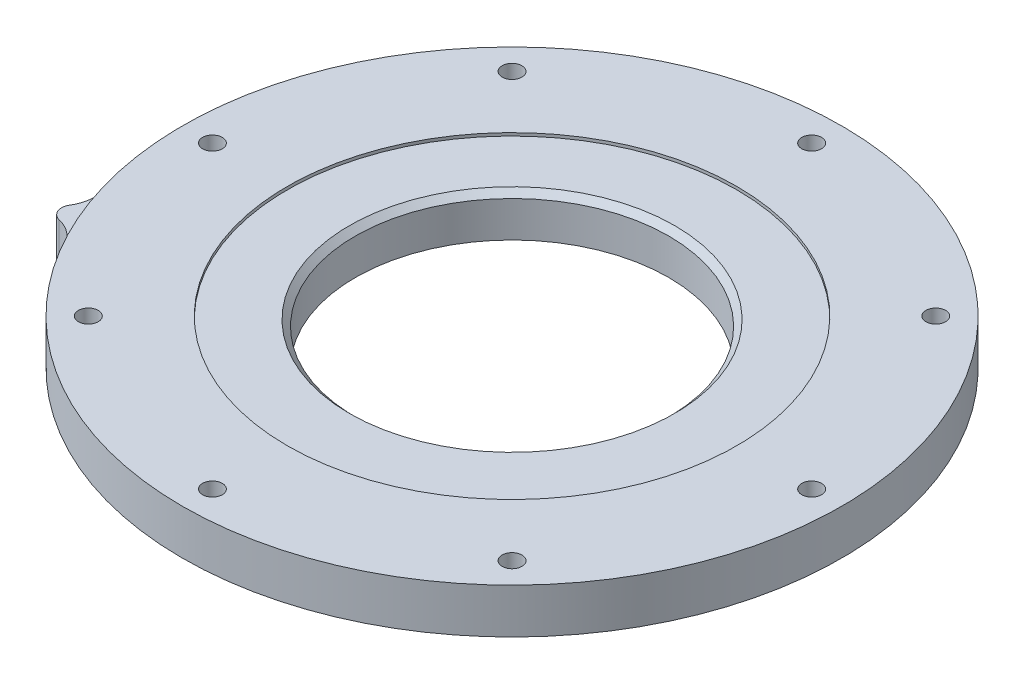
ISO-10303-21;
HEADER;
FILE_DESCRIPTION(('STEP AP214'),'2;1');
FILE_NAME('part.step','',(''),(''),'','','');
FILE_SCHEMA(('AUTOMOTIVE_DESIGN { 1 0 10303 214 1 1 1 1 }'));
ENDSEC;
DATA;
#1=APPLICATION_CONTEXT('core data for automotive mechanical design processes');
#2=APPLICATION_PROTOCOL_DEFINITION('international standard','automotive_design',2000,#1);
#3=PRODUCT_CONTEXT('',#1,'mechanical');
#4=PRODUCT('Part','Part','',(#3));
#5=PRODUCT_RELATED_PRODUCT_CATEGORY('part','',(#4));
#6=PRODUCT_DEFINITION_FORMATION('','',#4);
#7=PRODUCT_DEFINITION_CONTEXT('part definition',#1,'design');
#8=PRODUCT_DEFINITION('design','',#6,#7);
#9=PRODUCT_DEFINITION_SHAPE('','',#8);
#10=(LENGTH_UNIT() NAMED_UNIT(*) SI_UNIT(.MILLI.,.METRE.));
#11=(NAMED_UNIT(*) PLANE_ANGLE_UNIT() SI_UNIT($,.RADIAN.));
#12=(NAMED_UNIT(*) SI_UNIT($,.STERADIAN.) SOLID_ANGLE_UNIT());
#13=UNCERTAINTY_MEASURE_WITH_UNIT(LENGTH_MEASURE(1.E-05),#10,'distance_accuracy_value','');
#14=(GEOMETRIC_REPRESENTATION_CONTEXT(3) GLOBAL_UNCERTAINTY_ASSIGNED_CONTEXT((#13)) GLOBAL_UNIT_ASSIGNED_CONTEXT((#10,
#11,#12)) REPRESENTATION_CONTEXT('',''));
#15=CARTESIAN_POINT('',(0.,0.,0.));
#16=DIRECTION('',(0.,0.,1.));
#17=DIRECTION('',(1.,0.,0.));
#18=AXIS2_PLACEMENT_3D('',#15,#16,#17);
#19=CARTESIAN_POINT('',(0.,0.5,-50.));
#20=DIRECTION('',(0.,-1.,0.));
#21=DIRECTION('',(0.,0.,-1.));
#22=AXIS2_PLACEMENT_3D('',#19,#20,#21);
#23=CYLINDRICAL_SURFACE('',#22,1.65);
#24=CARTESIAN_POINT('',(0.,0.5,-50.));
#25=DIRECTION('',(0.,1.,0.));
#26=DIRECTION('',(0.,0.,1.));
#27=AXIS2_PLACEMENT_3D('',#24,#25,#26);
#28=CIRCLE('',#27,1.65);
#29=CARTESIAN_POINT('',(0.,0.5,-48.35));
#30=VERTEX_POINT('',#29);
#31=EDGE_CURVE('E143',#30,#30,#28,.T.);
#32=ORIENTED_EDGE('',*,*,#31,.T.);
#33=EDGE_LOOP('',(#32));
#34=FACE_BOUND('',#33,.T.);
#35=CARTESIAN_POINT('',(0.,-3.,-50.));
#36=DIRECTION('',(0.,-1.,0.));
#37=DIRECTION('',(0.,0.,-1.));
#38=AXIS2_PLACEMENT_3D('',#35,#36,#37);
#39=CIRCLE('',#38,1.65);
#40=CARTESIAN_POINT('',(0.,-3.,-51.65));
#41=VERTEX_POINT('',#40);
#42=EDGE_CURVE('E258',#41,#41,#39,.T.);
#43=ORIENTED_EDGE('',*,*,#42,.T.);
#44=EDGE_LOOP('',(#43));
#45=FACE_BOUND('',#44,.T.);
#46=ADVANCED_FACE('F43',(#34,#45),#23,.F.);
#47=CARTESIAN_POINT('',(35.3553390593274,0.5,-35.3553390593274));
#48=DIRECTION('',(0.,-1.,0.));
#49=DIRECTION('',(0.,0.,-1.));
#50=AXIS2_PLACEMENT_3D('',#47,#48,#49);
#51=CYLINDRICAL_SURFACE('',#50,1.65);
#52=CARTESIAN_POINT('',(35.3553390593274,0.5,-35.3553390593274));
#53=DIRECTION('',(0.,1.,0.));
#54=DIRECTION('',(0.,0.,1.));
#55=AXIS2_PLACEMENT_3D('',#52,#53,#54);
#56=CIRCLE('',#55,1.65);
#57=CARTESIAN_POINT('',(35.3553390593274,0.5,-33.7053390593274));
#58=VERTEX_POINT('',#57);
#59=EDGE_CURVE('E140',#58,#58,#56,.T.);
#60=ORIENTED_EDGE('',*,*,#59,.T.);
#61=EDGE_LOOP('',(#60));
#62=FACE_BOUND('',#61,.T.);
#63=CARTESIAN_POINT('',(35.3553390593274,-3.,-35.3553390593274));
#64=DIRECTION('',(0.,-1.,0.));
#65=DIRECTION('',(0.,0.,-1.));
#66=AXIS2_PLACEMENT_3D('',#63,#64,#65);
#67=CIRCLE('',#66,1.65);
#68=CARTESIAN_POINT('',(35.3553390593274,-3.,-37.0053390593274));
#69=VERTEX_POINT('',#68);
#70=EDGE_CURVE('E249',#69,#69,#67,.T.);
#71=ORIENTED_EDGE('',*,*,#70,.T.);
#72=EDGE_LOOP('',(#71));
#73=FACE_BOUND('',#72,.T.);
#74=ADVANCED_FACE('F177',(#62,#73),#51,.F.);
#75=CARTESIAN_POINT('',(50.,0.5,0.));
#76=DIRECTION('',(0.,-1.,0.));
#77=DIRECTION('',(0.,0.,-1.));
#78=AXIS2_PLACEMENT_3D('',#75,#76,#77);
#79=CYLINDRICAL_SURFACE('',#78,1.65);
#80=CARTESIAN_POINT('',(50.,0.5,0.));
#81=DIRECTION('',(0.,1.,0.));
#82=DIRECTION('',(0.,0.,1.));
#83=AXIS2_PLACEMENT_3D('',#80,#81,#82);
#84=CIRCLE('',#83,1.65);
#85=CARTESIAN_POINT('',(50.,0.5,1.65));
#86=VERTEX_POINT('',#85);
#87=EDGE_CURVE('E137',#86,#86,#84,.T.);
#88=ORIENTED_EDGE('',*,*,#87,.T.);
#89=EDGE_LOOP('',(#88));
#90=FACE_BOUND('',#89,.T.);
#91=CARTESIAN_POINT('',(50.,-3.,0.));
#92=DIRECTION('',(0.,-1.,0.));
#93=DIRECTION('',(0.,0.,-1.));
#94=AXIS2_PLACEMENT_3D('',#91,#92,#93);
#95=CIRCLE('',#94,1.65);
#96=CARTESIAN_POINT('',(50.,-3.,-1.65000000000001));
#97=VERTEX_POINT('',#96);
#98=EDGE_CURVE('E240',#97,#97,#95,.T.);
#99=ORIENTED_EDGE('',*,*,#98,.T.);
#100=EDGE_LOOP('',(#99));
#101=FACE_BOUND('',#100,.T.);
#102=ADVANCED_FACE('F183',(#90,#101),#79,.F.);
#103=CARTESIAN_POINT('',(35.3553390593274,0.5,35.3553390593274));
#104=DIRECTION('',(0.,-1.,0.));
#105=DIRECTION('',(0.,0.,-1.));
#106=AXIS2_PLACEMENT_3D('',#103,#104,#105);
#107=CYLINDRICAL_SURFACE('',#106,1.65);
#108=CARTESIAN_POINT('',(35.3553390593274,0.5,35.3553390593274));
#109=DIRECTION('',(0.,1.,0.));
#110=DIRECTION('',(0.,0.,1.));
#111=AXIS2_PLACEMENT_3D('',#108,#109,#110);
#112=CIRCLE('',#111,1.65);
#113=CARTESIAN_POINT('',(35.3553390593274,0.5,37.0053390593274));
#114=VERTEX_POINT('',#113);
#115=EDGE_CURVE('E134',#114,#114,#112,.T.);
#116=ORIENTED_EDGE('',*,*,#115,.T.);
#117=EDGE_LOOP('',(#116));
#118=FACE_BOUND('',#117,.T.);
#119=CARTESIAN_POINT('',(35.3553390593274,-3.,35.3553390593274));
#120=DIRECTION('',(0.,-1.,0.));
#121=DIRECTION('',(0.,0.,-1.));
#122=AXIS2_PLACEMENT_3D('',#119,#120,#121);
#123=CIRCLE('',#122,1.65);
#124=CARTESIAN_POINT('',(35.3553390593274,-3.,33.7053390593274));
#125=VERTEX_POINT('',#124);
#126=EDGE_CURVE('E231',#125,#125,#123,.T.);
#127=ORIENTED_EDGE('',*,*,#126,.T.);
#128=EDGE_LOOP('',(#127));
#129=FACE_BOUND('',#128,.T.);
#130=ADVANCED_FACE('F356',(#118,#129),#107,.F.);
#131=CARTESIAN_POINT('',(0.,0.5,50.));
#132=DIRECTION('',(0.,-1.,0.));
#133=DIRECTION('',(0.,0.,-1.));
#134=AXIS2_PLACEMENT_3D('',#131,#132,#133);
#135=CYLINDRICAL_SURFACE('',#134,1.65);
#136=CARTESIAN_POINT('',(0.,0.5,50.));
#137=DIRECTION('',(0.,1.,0.));
#138=DIRECTION('',(0.,0.,1.));
#139=AXIS2_PLACEMENT_3D('',#136,#137,#138);
#140=CIRCLE('',#139,1.65);
#141=CARTESIAN_POINT('',(0.,0.5,51.65));
#142=VERTEX_POINT('',#141);
#143=EDGE_CURVE('E131',#142,#142,#140,.T.);
#144=ORIENTED_EDGE('',*,*,#143,.T.);
#145=EDGE_LOOP('',(#144));
#146=FACE_BOUND('',#145,.T.);
#147=CARTESIAN_POINT('',(0.,-3.,50.));
#148=DIRECTION('',(0.,-1.,0.));
#149=DIRECTION('',(0.,0.,-1.));
#150=AXIS2_PLACEMENT_3D('',#147,#148,#149);
#151=CIRCLE('',#150,1.65);
#152=CARTESIAN_POINT('',(0.,-3.,48.35));
#153=VERTEX_POINT('',#152);
#154=EDGE_CURVE('E222',#153,#153,#151,.T.);
#155=ORIENTED_EDGE('',*,*,#154,.T.);
#156=EDGE_LOOP('',(#155));
#157=FACE_BOUND('',#156,.T.);
#158=ADVANCED_FACE('F352',(#146,#157),#135,.F.);
#159=CARTESIAN_POINT('',(-35.3553390593274,0.5,35.3553390593274));
#160=DIRECTION('',(0.,-1.,0.));
#161=DIRECTION('',(0.,0.,-1.));
#162=AXIS2_PLACEMENT_3D('',#159,#160,#161);
#163=CYLINDRICAL_SURFACE('',#162,1.65);
#164=CARTESIAN_POINT('',(-35.3553390593274,0.5,35.3553390593274));
#165=DIRECTION('',(0.,1.,0.));
#166=DIRECTION('',(0.,0.,1.));
#167=AXIS2_PLACEMENT_3D('',#164,#165,#166);
#168=CIRCLE('',#167,1.65);
#169=CARTESIAN_POINT('',(-35.3553390593274,0.5,37.0053390593274));
#170=VERTEX_POINT('',#169);
#171=EDGE_CURVE('E128',#170,#170,#168,.T.);
#172=ORIENTED_EDGE('',*,*,#171,.T.);
#173=EDGE_LOOP('',(#172));
#174=FACE_BOUND('',#173,.T.);
#175=CARTESIAN_POINT('',(-35.3553390593274,-3.,35.3553390593274));
#176=DIRECTION('',(0.,-1.,0.));
#177=DIRECTION('',(0.,0.,-1.));
#178=AXIS2_PLACEMENT_3D('',#175,#176,#177);
#179=CIRCLE('',#178,1.65);
#180=CARTESIAN_POINT('',(-35.3553390593274,-3.,33.7053390593274));
#181=VERTEX_POINT('',#180);
#182=EDGE_CURVE('E212',#181,#181,#179,.T.);
#183=ORIENTED_EDGE('',*,*,#182,.T.);
#184=EDGE_LOOP('',(#183));
#185=FACE_BOUND('',#184,.T.);
#186=ADVANCED_FACE('F348',(#174,#185),#163,.F.);
#187=CARTESIAN_POINT('',(-50.,0.5,0.));
#188=DIRECTION('',(0.,-1.,0.));
#189=DIRECTION('',(0.,0.,-1.));
#190=AXIS2_PLACEMENT_3D('',#187,#188,#189);
#191=CYLINDRICAL_SURFACE('',#190,1.65);
#192=CARTESIAN_POINT('',(-50.,0.5,0.));
#193=DIRECTION('',(0.,1.,0.));
#194=DIRECTION('',(0.,0.,1.));
#195=AXIS2_PLACEMENT_3D('',#192,#193,#194);
#196=CIRCLE('',#195,1.65);
#197=CARTESIAN_POINT('',(-50.,0.5,1.65000000000001));
#198=VERTEX_POINT('',#197);
#199=EDGE_CURVE('E125',#198,#198,#196,.T.);
#200=ORIENTED_EDGE('',*,*,#199,.T.);
#201=EDGE_LOOP('',(#200));
#202=FACE_BOUND('',#201,.T.);
#203=CARTESIAN_POINT('',(-50.,-3.,0.));
#204=DIRECTION('',(0.,-1.,0.));
#205=DIRECTION('',(0.,0.,-1.));
#206=AXIS2_PLACEMENT_3D('',#203,#204,#205);
#207=CIRCLE('',#206,1.65);
#208=CARTESIAN_POINT('',(-50.,-3.,-1.64999999999999));
#209=VERTEX_POINT('',#208);
#210=EDGE_CURVE('E270',#209,#209,#207,.T.);
#211=ORIENTED_EDGE('',*,*,#210,.T.);
#212=EDGE_LOOP('',(#211));
#213=FACE_BOUND('',#212,.T.);
#214=ADVANCED_FACE('F284',(#202,#213),#191,.F.);
#215=CARTESIAN_POINT('',(-35.3553390593274,0.5,-35.3553390593274));
#216=DIRECTION('',(0.,-1.,0.));
#217=DIRECTION('',(0.,0.,-1.));
#218=AXIS2_PLACEMENT_3D('',#215,#216,#217);
#219=CYLINDRICAL_SURFACE('',#218,1.65);
#220=CARTESIAN_POINT('',(-35.3553390593274,0.5,-35.3553390593274));
#221=DIRECTION('',(0.,1.,0.));
#222=DIRECTION('',(0.,0.,1.));
#223=AXIS2_PLACEMENT_3D('',#220,#221,#222);
#224=CIRCLE('',#223,1.65);
#225=CARTESIAN_POINT('',(-35.3553390593274,0.5,-33.7053390593274));
#226=VERTEX_POINT('',#225);
#227=EDGE_CURVE('E122',#226,#226,#224,.T.);
#228=ORIENTED_EDGE('',*,*,#227,.T.);
#229=EDGE_LOOP('',(#228));
#230=FACE_BOUND('',#229,.T.);
#231=CARTESIAN_POINT('',(-35.3553390593274,-3.,-35.3553390593274));
#232=DIRECTION('',(0.,-1.,0.));
#233=DIRECTION('',(0.,0.,-1.));
#234=AXIS2_PLACEMENT_3D('',#231,#232,#233);
#235=CIRCLE('',#234,1.65);
#236=CARTESIAN_POINT('',(-35.3553390593274,-3.,-37.0053390593274));
#237=VERTEX_POINT('',#236);
#238=EDGE_CURVE('E267',#237,#237,#235,.T.);
#239=ORIENTED_EDGE('',*,*,#238,.T.);
#240=EDGE_LOOP('',(#239));
#241=FACE_BOUND('',#240,.T.);
#242=ADVANCED_FACE('F196',(#230,#241),#219,.F.);
#243=CARTESIAN_POINT('',(0.,0.5,0.));
#244=DIRECTION('',(0.,1.,0.));
#245=DIRECTION('',(0.,0.,1.));
#246=AXIS2_PLACEMENT_3D('',#243,#244,#245);
#247=PLANE('',#246);
#248=ORIENTED_EDGE('',*,*,#199,.F.);
#249=EDGE_LOOP('',(#248));
#250=FACE_BOUND('',#249,.T.);
#251=ORIENTED_EDGE('',*,*,#143,.F.);
#252=EDGE_LOOP('',(#251));
#253=FACE_BOUND('',#252,.T.);
#254=ORIENTED_EDGE('',*,*,#87,.F.);
#255=EDGE_LOOP('',(#254));
#256=FACE_BOUND('',#255,.T.);
#257=ORIENTED_EDGE('',*,*,#31,.F.);
#258=EDGE_LOOP('',(#257));
#259=FACE_BOUND('',#258,.T.);
#260=CARTESIAN_POINT('',(0.,0.5,0.));
#261=DIRECTION('',(0.,1.,0.));
#262=DIRECTION('',(0.,0.,1.));
#263=AXIS2_PLACEMENT_3D('',#260,#261,#262);
#264=CIRCLE('',#263,55.);
#265=CARTESIAN_POINT('',(0.,0.5,55.));
#266=VERTEX_POINT('',#265);
#267=EDGE_CURVE('E153',#266,#266,#264,.T.);
#268=ORIENTED_EDGE('',*,*,#267,.T.);
#269=EDGE_LOOP('',(#268));
#270=FACE_BOUND('',#269,.T.);
#271=CARTESIAN_POINT('',(0.,0.5,0.));
#272=DIRECTION('',(0.,1.,0.));
#273=DIRECTION('',(0.,0.,1.));
#274=AXIS2_PLACEMENT_3D('',#271,#272,#273);
#275=CIRCLE('',#274,37.5);
#276=CARTESIAN_POINT('',(0.,0.5,37.5));
#277=VERTEX_POINT('',#276);
#278=EDGE_CURVE('E147',#277,#277,#275,.T.);
#279=ORIENTED_EDGE('',*,*,#278,.F.);
#280=EDGE_LOOP('',(#279));
#281=FACE_BOUND('',#280,.T.);
#282=ORIENTED_EDGE('',*,*,#59,.F.);
#283=EDGE_LOOP('',(#282));
#284=FACE_BOUND('',#283,.T.);
#285=ORIENTED_EDGE('',*,*,#115,.F.);
#286=EDGE_LOOP('',(#285));
#287=FACE_BOUND('',#286,.T.);
#288=ORIENTED_EDGE('',*,*,#171,.F.);
#289=EDGE_LOOP('',(#288));
#290=FACE_BOUND('',#289,.T.);
#291=ORIENTED_EDGE('',*,*,#227,.F.);
#292=EDGE_LOOP('',(#291));
#293=FACE_BOUND('',#292,.T.);
#294=ADVANCED_FACE('F194',(#250,#253,#256,#259,#270,#281,#284,#287,#290,#293),#247,.T.);
#295=CARTESIAN_POINT('',(0.,0.5,0.));
#296=DIRECTION('',(0.,-1.,0.));
#297=DIRECTION('',(0.,0.,-1.));
#298=AXIS2_PLACEMENT_3D('',#295,#296,#297);
#299=CYLINDRICAL_SURFACE('',#298,55.);
#300=ORIENTED_EDGE('',*,*,#267,.F.);
#301=EDGE_LOOP('',(#300));
#302=FACE_BOUND('',#301,.T.);
#303=CARTESIAN_POINT('',(0.,0.,0.));
#304=DIRECTION('',(0.,1.,0.));
#305=DIRECTION('',(0.,0.,1.));
#306=AXIS2_PLACEMENT_3D('',#303,#304,#305);
#307=CIRCLE('',#306,55.);
#308=CARTESIAN_POINT('',(-52.7690267796825,0.,15.5057993255799));
#309=VERTEX_POINT('',#308);
#310=CARTESIAN_POINT('',(-48.2775925233631,0.,26.349080821693));
#311=VERTEX_POINT('',#310);
#312=EDGE_CURVE('E150',#309,#311,#307,.T.);
#313=ORIENTED_EDGE('',*,*,#312,.T.);
#314=DIRECTION('',(0.,1.,0.));
#315=VECTOR('',#314,1.);
#316=CARTESIAN_POINT('',(-48.2775925233631,-7.,26.349080821693));
#317=LINE('',#316,#315);
#318=CARTESIAN_POINT('',(-48.2775925233631,-7.,26.349080821693));
#319=VERTEX_POINT('',#318);
#320=EDGE_CURVE('E84',#319,#311,#317,.T.);
#321=ORIENTED_EDGE('',*,*,#320,.F.);
#322=CARTESIAN_POINT('',(0.,-7.,0.));
#323=DIRECTION('',(0.,-1.,0.));
#324=DIRECTION('',(0.,0.,-1.));
#325=AXIS2_PLACEMENT_3D('',#322,#323,#324);
#326=CIRCLE('',#325,55.);
#327=CARTESIAN_POINT('',(-52.7690267796825,-7.,15.5057993255799));
#328=VERTEX_POINT('',#327);
#329=EDGE_CURVE('E67',#328,#319,#326,.T.);
#330=ORIENTED_EDGE('',*,*,#329,.F.);
#331=DIRECTION('',(0.,1.,0.));
#332=VECTOR('',#331,1.);
#333=CARTESIAN_POINT('',(-52.7690267796825,-7.,15.5057993255799));
#334=LINE('',#333,#332);
#335=EDGE_CURVE('E59',#328,#309,#334,.T.);
#336=ORIENTED_EDGE('',*,*,#335,.T.);
#337=EDGE_LOOP('',(#313,#321,#330,#336));
#338=FACE_BOUND('',#337,.T.);
#339=ADVANCED_FACE('F192',(#302,#338),#299,.T.);
#340=CARTESIAN_POINT('',(0.,0.5,0.));
#341=DIRECTION('',(0.,-1.,0.));
#342=DIRECTION('',(0.,0.,-1.));
#343=AXIS2_PLACEMENT_3D('',#340,#341,#342);
#344=CYLINDRICAL_SURFACE('',#343,37.5);
#345=ORIENTED_EDGE('',*,*,#278,.T.);
#346=EDGE_LOOP('',(#345));
#347=FACE_BOUND('',#346,.T.);
#348=CARTESIAN_POINT('',(0.,0.,0.));
#349=DIRECTION('',(0.,1.,0.));
#350=DIRECTION('',(0.,0.,1.));
#351=AXIS2_PLACEMENT_3D('',#348,#349,#350);
#352=CIRCLE('',#351,37.5);
#353=CARTESIAN_POINT('',(0.,0.,37.5));
#354=VERTEX_POINT('',#353);
#355=EDGE_CURVE('E146',#354,#354,#352,.T.);
#356=ORIENTED_EDGE('',*,*,#355,.F.);
#357=EDGE_LOOP('',(#356));
#358=FACE_BOUND('',#357,.T.);
#359=ADVANCED_FACE('F189',(#347,#358),#344,.F.);
#360=CARTESIAN_POINT('',(-26.7721194902286,0.,14.6117630011207));
#361=DIRECTION('',(0.,-1.,0.));
#362=DIRECTION('',(0.,0.,-1.));
#363=AXIS2_PLACEMENT_3D('',#360,#361,#362);
#364=PLANE('',#363);
#365=CARTESIAN_POINT('',(0.,0.,0.));
#366=DIRECTION('',(0.,-1.,0.));
#367=DIRECTION('',(0.,0.,-1.));
#368=AXIS2_PLACEMENT_3D('',#365,#366,#367);
#369=CIRCLE('',#368,27.15);
#370=CARTESIAN_POINT('',(0.,0.,-27.15));
#371=VERTEX_POINT('',#370);
#372=EDGE_CURVE('E52',#371,#371,#369,.T.);
#373=ORIENTED_EDGE('',*,*,#372,.T.);
#374=EDGE_LOOP('',(#373));
#375=FACE_BOUND('',#374,.T.);
#376=ORIENTED_EDGE('',*,*,#355,.T.);
#377=EDGE_LOOP('',(#376));
#378=FACE_BOUND('',#377,.T.);
#379=ADVANCED_FACE('F159',(#375,#378),#364,.F.);
#380=CARTESIAN_POINT('',(-26.7721194902286,-7.,14.6117630011207));
#381=DIRECTION('',(0.,-1.,0.));
#382=DIRECTION('',(0.,0.,-1.));
#383=AXIS2_PLACEMENT_3D('',#380,#381,#382);
#384=PLANE('',#383);
#385=CARTESIAN_POINT('',(-50.,-7.,0.));
#386=DIRECTION('',(0.,-1.,0.));
#387=DIRECTION('',(0.,0.,-1.));
#388=AXIS2_PLACEMENT_3D('',#385,#386,#387);
#389=CIRCLE('',#388,3.65);
#390=CARTESIAN_POINT('',(-50.,-7.,-3.64999999999999));
#391=VERTEX_POINT('',#390);
#392=EDGE_CURVE('E276',#391,#391,#389,.T.);
#393=ORIENTED_EDGE('',*,*,#392,.F.);
#394=EDGE_LOOP('',(#393));
#395=FACE_BOUND('',#394,.T.);
#396=CARTESIAN_POINT('',(-35.3553390593274,-7.,-35.3553390593274));
#397=DIRECTION('',(0.,-1.,0.));
#398=DIRECTION('',(0.,0.,-1.));
#399=AXIS2_PLACEMENT_3D('',#396,#397,#398);
#400=CIRCLE('',#399,3.64999999999999);
#401=CARTESIAN_POINT('',(-35.3553390593274,-7.,-39.0053390593274));
#402=VERTEX_POINT('',#401);
#403=EDGE_CURVE('E271',#402,#402,#400,.T.);
#404=ORIENTED_EDGE('',*,*,#403,.F.);
#405=EDGE_LOOP('',(#404));
#406=FACE_BOUND('',#405,.T.);
#407=CARTESIAN_POINT('',(0.,-7.,-50.));
#408=DIRECTION('',(0.,-1.,0.));
#409=DIRECTION('',(0.,0.,-1.));
#410=AXIS2_PLACEMENT_3D('',#407,#408,#409);
#411=CIRCLE('',#410,3.65);
#412=CARTESIAN_POINT('',(0.,-7.,-53.65));
#413=VERTEX_POINT('',#412);
#414=EDGE_CURVE('E262',#413,#413,#411,.T.);
#415=ORIENTED_EDGE('',*,*,#414,.F.);
#416=EDGE_LOOP('',(#415));
#417=FACE_BOUND('',#416,.T.);
#418=CARTESIAN_POINT('',(35.3553390593274,-7.,-35.3553390593274));
#419=DIRECTION('',(0.,-1.,0.));
#420=DIRECTION('',(0.,0.,-1.));
#421=AXIS2_PLACEMENT_3D('',#418,#419,#420);
#422=CIRCLE('',#421,3.65);
#423=CARTESIAN_POINT('',(35.3553390593274,-7.,-39.0053390593274));
#424=VERTEX_POINT('',#423);
#425=EDGE_CURVE('E253',#424,#424,#422,.T.);
#426=ORIENTED_EDGE('',*,*,#425,.F.);
#427=EDGE_LOOP('',(#426));
#428=FACE_BOUND('',#427,.T.);
#429=CARTESIAN_POINT('',(50.,-7.,0.));
#430=DIRECTION('',(0.,-1.,0.));
#431=DIRECTION('',(0.,0.,-1.));
#432=AXIS2_PLACEMENT_3D('',#429,#430,#431);
#433=CIRCLE('',#432,3.65);
#434=CARTESIAN_POINT('',(50.,-7.,-3.65));
#435=VERTEX_POINT('',#434);
#436=EDGE_CURVE('E244',#435,#435,#433,.T.);
#437=ORIENTED_EDGE('',*,*,#436,.F.);
#438=EDGE_LOOP('',(#437));
#439=FACE_BOUND('',#438,.T.);
#440=CARTESIAN_POINT('',(35.3553390593274,-7.,35.3553390593274));
#441=DIRECTION('',(0.,-1.,0.));
#442=DIRECTION('',(0.,0.,-1.));
#443=AXIS2_PLACEMENT_3D('',#440,#441,#442);
#444=CIRCLE('',#443,3.64999999999999);
#445=CARTESIAN_POINT('',(35.3553390593274,-7.,31.7053390593274));
#446=VERTEX_POINT('',#445);
#447=EDGE_CURVE('E235',#446,#446,#444,.T.);
#448=ORIENTED_EDGE('',*,*,#447,.F.);
#449=EDGE_LOOP('',(#448));
#450=FACE_BOUND('',#449,.T.);
#451=CARTESIAN_POINT('',(0.,-7.,50.));
#452=DIRECTION('',(0.,-1.,0.));
#453=DIRECTION('',(0.,0.,-1.));
#454=AXIS2_PLACEMENT_3D('',#451,#452,#453);
#455=CIRCLE('',#454,3.65);
#456=CARTESIAN_POINT('',(0.,-7.,46.35));
#457=VERTEX_POINT('',#456);
#458=EDGE_CURVE('E226',#457,#457,#455,.T.);
#459=ORIENTED_EDGE('',*,*,#458,.F.);
#460=EDGE_LOOP('',(#459));
#461=FACE_BOUND('',#460,.T.);
#462=CARTESIAN_POINT('',(-35.3553390593274,-7.,35.3553390593274));
#463=DIRECTION('',(0.,-1.,0.));
#464=DIRECTION('',(0.,0.,-1.));
#465=AXIS2_PLACEMENT_3D('',#462,#463,#464);
#466=CIRCLE('',#465,3.65);
#467=CARTESIAN_POINT('',(-35.3553390593274,-7.,31.7053390593274));
#468=VERTEX_POINT('',#467);
#469=EDGE_CURVE('E216',#468,#468,#466,.T.);
#470=ORIENTED_EDGE('',*,*,#469,.F.);
#471=EDGE_LOOP('',(#470));
#472=FACE_BOUND('',#471,.T.);
#473=CARTESIAN_POINT('',(-53.5442389804573,-7.,29.2235260022414));
#474=DIRECTION('',(0.,1.,0.));
#475=DIRECTION('',(0.,0.,-1.));
#476=AXIS2_PLACEMENT_3D('',#473,#474,#475);
#477=CIRCLE('',#476,6.);
#478=CARTESIAN_POINT('',(-52.1890001105883,-7.,23.3785856598943));
#479=VERTEX_POINT('',#478);
#480=EDGE_CURVE('E97',#319,#479,#477,.T.);
#481=ORIENTED_EDGE('',*,*,#480,.T.);
#482=CARTESIAN_POINT('',(-51.737253820632,-7.,21.4302722124452));
#483=DIRECTION('',(0.,-1.,0.));
#484=DIRECTION('',(0.,0.,-1.));
#485=AXIS2_PLACEMENT_3D('',#482,#483,#484);
#486=CIRCLE('',#485,2.00000000000006);
#487=CARTESIAN_POINT('',(-53.4343523362041,-7.,20.3720394268811));
#488=VERTEX_POINT('',#487);
#489=EDGE_CURVE('E92',#479,#488,#486,.T.);
#490=ORIENTED_EDGE('',*,*,#489,.T.);
#491=CARTESIAN_POINT('',(-58.5256478829206,-7.,17.1973410701886));
#492=DIRECTION('',(0.,1.,0.));
#493=DIRECTION('',(0.,0.,1.));
#494=AXIS2_PLACEMENT_3D('',#491,#492,#493);
#495=CIRCLE('',#494,6.);
#496=EDGE_CURVE('E96',#488,#328,#495,.T.);
#497=ORIENTED_EDGE('',*,*,#496,.T.);
#498=ORIENTED_EDGE('',*,*,#329,.T.);
#499=EDGE_LOOP('',(#481,#490,#497,#498));
#500=FACE_BOUND('',#499,.T.);
#501=CARTESIAN_POINT('',(0.,-7.,0.));
#502=DIRECTION('',(0.,-1.,0.));
#503=DIRECTION('',(0.,0.,-1.));
#504=AXIS2_PLACEMENT_3D('',#501,#502,#503);
#505=CIRCLE('',#504,26.15);
#506=CARTESIAN_POINT('',(0.,-7.,-26.15));
#507=VERTEX_POINT('',#506);
#508=EDGE_CURVE('E115',#507,#507,#505,.T.);
#509=ORIENTED_EDGE('',*,*,#508,.F.);
#510=EDGE_LOOP('',(#509));
#511=FACE_BOUND('',#510,.T.);
#512=ADVANCED_FACE('F93',(#395,#406,#417,#428,#439,#450,#461,#472,#500,#511),#384,.T.);
#513=ORIENTED_EDGE('',*,*,#312,.F.);
#514=CARTESIAN_POINT('',(-58.5256478829206,0.,17.1973410701886));
#515=DIRECTION('',(0.,1.,0.));
#516=DIRECTION('',(0.,0.,1.));
#517=AXIS2_PLACEMENT_3D('',#514,#515,#516);
#518=CIRCLE('',#517,6.);
#519=CARTESIAN_POINT('',(-53.4343523362041,0.,20.3720394268811));
#520=VERTEX_POINT('',#519);
#521=EDGE_CURVE('E117',#520,#309,#518,.T.);
#522=ORIENTED_EDGE('',*,*,#521,.F.);
#523=CARTESIAN_POINT('',(-51.737253820632,0.,21.4302722124452));
#524=DIRECTION('',(0.,-1.,0.));
#525=DIRECTION('',(0.,0.,-1.));
#526=AXIS2_PLACEMENT_3D('',#523,#524,#525);
#527=CIRCLE('',#526,2.00000000000006);
#528=CARTESIAN_POINT('',(-52.1890001105883,0.,23.3785856598943));
#529=VERTEX_POINT('',#528);
#530=EDGE_CURVE('E103',#529,#520,#527,.T.);
#531=ORIENTED_EDGE('',*,*,#530,.F.);
#532=CARTESIAN_POINT('',(-53.5442389804573,0.,29.2235260022414));
#533=DIRECTION('',(0.,1.,0.));
#534=DIRECTION('',(0.,0.,-1.));
#535=AXIS2_PLACEMENT_3D('',#532,#533,#534);
#536=CIRCLE('',#535,6.);
#537=EDGE_CURVE('E113',#311,#529,#536,.T.);
#538=ORIENTED_EDGE('',*,*,#537,.F.);
#539=EDGE_LOOP('',(#513,#522,#531,#538));
#540=FACE_BOUND('',#539,.T.);
#541=ADVANCED_FACE('F206',(#540),#364,.F.);
#542=CARTESIAN_POINT('',(-53.5442389804573,-7.,29.2235260022414));
#543=DIRECTION('',(0.,1.,0.));
#544=DIRECTION('',(0.,0.,1.));
#545=AXIS2_PLACEMENT_3D('',#542,#543,#544);
#546=CYLINDRICAL_SURFACE('',#545,6.);
#547=ORIENTED_EDGE('',*,*,#537,.T.);
#548=DIRECTION('',(0.,1.,0.));
#549=VECTOR('',#548,1.);
#550=CARTESIAN_POINT('',(-52.1890001105883,-7.,23.3785856598943));
#551=LINE('',#550,#549);
#552=EDGE_CURVE('E106',#479,#529,#551,.T.);
#553=ORIENTED_EDGE('',*,*,#552,.F.);
#554=ORIENTED_EDGE('',*,*,#480,.F.);
#555=ORIENTED_EDGE('',*,*,#320,.T.);
#556=EDGE_LOOP('',(#547,#553,#554,#555));
#557=FACE_BOUND('',#556,.T.);
#558=ADVANCED_FACE('F207',(#557),#546,.F.);
#559=CARTESIAN_POINT('',(-51.737253820632,-7.,21.4302722124452));
#560=DIRECTION('',(0.,1.,0.));
#561=DIRECTION('',(0.,0.,1.));
#562=AXIS2_PLACEMENT_3D('',#559,#560,#561);
#563=CYLINDRICAL_SURFACE('',#562,2.00000000000006);
#564=ORIENTED_EDGE('',*,*,#530,.T.);
#565=DIRECTION('',(0.,1.,0.));
#566=VECTOR('',#565,1.);
#567=CARTESIAN_POINT('',(-53.4343523362041,-7.,20.3720394268811));
#568=LINE('',#567,#566);
#569=EDGE_CURVE('E101',#488,#520,#568,.T.);
#570=ORIENTED_EDGE('',*,*,#569,.F.);
#571=ORIENTED_EDGE('',*,*,#489,.F.);
#572=ORIENTED_EDGE('',*,*,#552,.T.);
#573=EDGE_LOOP('',(#564,#570,#571,#572));
#574=FACE_BOUND('',#573,.T.);
#575=ADVANCED_FACE('F102',(#574),#563,.T.);
#576=CARTESIAN_POINT('',(-58.5256478829206,-7.,17.1973410701886));
#577=DIRECTION('',(0.,1.,0.));
#578=DIRECTION('',(0.,0.,1.));
#579=AXIS2_PLACEMENT_3D('',#576,#577,#578);
#580=CYLINDRICAL_SURFACE('',#579,6.);
#581=ORIENTED_EDGE('',*,*,#521,.T.);
#582=ORIENTED_EDGE('',*,*,#335,.F.);
#583=ORIENTED_EDGE('',*,*,#496,.F.);
#584=ORIENTED_EDGE('',*,*,#569,.T.);
#585=EDGE_LOOP('',(#581,#582,#583,#584));
#586=FACE_BOUND('',#585,.T.);
#587=ADVANCED_FACE('F108',(#586),#580,.F.);
#588=CARTESIAN_POINT('',(0.,-7.,0.));
#589=DIRECTION('',(0.,1.,0.));
#590=DIRECTION('',(0.,0.,1.));
#591=AXIS2_PLACEMENT_3D('',#588,#589,#590);
#592=CYLINDRICAL_SURFACE('',#591,26.15);
#593=CARTESIAN_POINT('',(0.,-1.,0.));
#594=DIRECTION('',(0.,-1.,0.));
#595=DIRECTION('',(0.,0.,-1.));
#596=AXIS2_PLACEMENT_3D('',#593,#594,#595);
#597=CIRCLE('',#596,26.15);
#598=CARTESIAN_POINT('',(0.,-1.,-26.15));
#599=VERTEX_POINT('',#598);
#600=EDGE_CURVE('E11',#599,#599,#597,.F.);
#601=ORIENTED_EDGE('',*,*,#600,.T.);
#602=EDGE_LOOP('',(#601));
#603=FACE_BOUND('',#602,.T.);
#604=ORIENTED_EDGE('',*,*,#508,.T.);
#605=EDGE_LOOP('',(#604));
#606=FACE_BOUND('',#605,.T.);
#607=ADVANCED_FACE('F164',(#603,#606),#592,.F.);
#608=CARTESIAN_POINT('',(0.,0.,0.));
#609=DIRECTION('',(0.,1.,0.));
#610=DIRECTION('',(0.,0.,1.));
#611=AXIS2_PLACEMENT_3D('',#608,#609,#610);
#612=CONICAL_SURFACE('',#611,27.15,0.785398163397452);
#613=ORIENTED_EDGE('',*,*,#600,.F.);
#614=EDGE_LOOP('',(#613));
#615=FACE_BOUND('',#614,.T.);
#616=ORIENTED_EDGE('',*,*,#372,.F.);
#617=EDGE_LOOP('',(#616));
#618=FACE_BOUND('',#617,.T.);
#619=ADVANCED_FACE('F46',(#615,#618),#612,.F.);
#620=CARTESIAN_POINT('',(-35.3553390593274,-3.,35.3553390593274));
#621=DIRECTION('',(0.,-1.,0.));
#622=DIRECTION('',(0.,0.,-1.));
#623=AXIS2_PLACEMENT_3D('',#620,#621,#622);
#624=CYLINDRICAL_SURFACE('',#623,3.65);
#625=CARTESIAN_POINT('',(-35.3553390593274,-3.,35.3553390593274));
#626=DIRECTION('',(0.,-1.,0.));
#627=DIRECTION('',(0.,0.,-1.));
#628=AXIS2_PLACEMENT_3D('',#625,#626,#627);
#629=CIRCLE('',#628,3.65);
#630=CARTESIAN_POINT('',(-35.3553390593274,-3.,31.7053390593274));
#631=VERTEX_POINT('',#630);
#632=EDGE_CURVE('E217',#631,#631,#629,.T.);
#633=ORIENTED_EDGE('',*,*,#632,.F.);
#634=EDGE_LOOP('',(#633));
#635=FACE_BOUND('',#634,.T.);
#636=ORIENTED_EDGE('',*,*,#469,.T.);
#637=EDGE_LOOP('',(#636));
#638=FACE_BOUND('',#637,.T.);
#639=ADVANCED_FACE('F163',(#635,#638),#624,.F.);
#640=CARTESIAN_POINT('',(-35.3553390593274,-3.,35.3553390593274));
#641=DIRECTION('',(0.,-1.,0.));
#642=DIRECTION('',(0.,0.,-1.));
#643=AXIS2_PLACEMENT_3D('',#640,#641,#642);
#644=PLANE('',#643);
#645=ORIENTED_EDGE('',*,*,#182,.F.);
#646=EDGE_LOOP('',(#645));
#647=FACE_BOUND('',#646,.T.);
#648=ORIENTED_EDGE('',*,*,#632,.T.);
#649=EDGE_LOOP('',(#648));
#650=FACE_BOUND('',#649,.T.);
#651=ADVANCED_FACE('F171',(#647,#650),#644,.T.);
#652=CARTESIAN_POINT('',(0.,-3.,50.));
#653=DIRECTION('',(0.,-1.,0.));
#654=DIRECTION('',(0.,0.,-1.));
#655=AXIS2_PLACEMENT_3D('',#652,#653,#654);
#656=CYLINDRICAL_SURFACE('',#655,3.65);
#657=CARTESIAN_POINT('',(0.,-3.,50.));
#658=DIRECTION('',(0.,-1.,0.));
#659=DIRECTION('',(0.,0.,-1.));
#660=AXIS2_PLACEMENT_3D('',#657,#658,#659);
#661=CIRCLE('',#660,3.65);
#662=CARTESIAN_POINT('',(0.,-3.,46.35));
#663=VERTEX_POINT('',#662);
#664=EDGE_CURVE('E215',#663,#663,#661,.T.);
#665=ORIENTED_EDGE('',*,*,#664,.F.);
#666=EDGE_LOOP('',(#665));
#667=FACE_BOUND('',#666,.T.);
#668=ORIENTED_EDGE('',*,*,#458,.T.);
#669=EDGE_LOOP('',(#668));
#670=FACE_BOUND('',#669,.T.);
#671=ADVANCED_FACE('F317',(#667,#670),#656,.F.);
#672=CARTESIAN_POINT('',(0.,-3.,50.));
#673=DIRECTION('',(0.,-1.,0.));
#674=DIRECTION('',(0.,0.,-1.));
#675=AXIS2_PLACEMENT_3D('',#672,#673,#674);
#676=PLANE('',#675);
#677=ORIENTED_EDGE('',*,*,#154,.F.);
#678=EDGE_LOOP('',(#677));
#679=FACE_BOUND('',#678,.T.);
#680=ORIENTED_EDGE('',*,*,#664,.T.);
#681=EDGE_LOOP('',(#680));
#682=FACE_BOUND('',#681,.T.);
#683=ADVANCED_FACE('F319',(#679,#682),#676,.T.);
#684=CARTESIAN_POINT('',(35.3553390593274,-3.,35.3553390593274));
#685=DIRECTION('',(0.,-1.,0.));
#686=DIRECTION('',(0.,0.,-1.));
#687=AXIS2_PLACEMENT_3D('',#684,#685,#686);
#688=CYLINDRICAL_SURFACE('',#687,3.64999999999999);
#689=CARTESIAN_POINT('',(35.3553390593274,-3.,35.3553390593274));
#690=DIRECTION('',(0.,-1.,0.));
#691=DIRECTION('',(0.,0.,-1.));
#692=AXIS2_PLACEMENT_3D('',#689,#690,#691);
#693=CIRCLE('',#692,3.64999999999999);
#694=CARTESIAN_POINT('',(35.3553390593274,-3.,31.7053390593274));
#695=VERTEX_POINT('',#694);
#696=EDGE_CURVE('E225',#695,#695,#693,.T.);
#697=ORIENTED_EDGE('',*,*,#696,.F.);
#698=EDGE_LOOP('',(#697));
#699=FACE_BOUND('',#698,.T.);
#700=ORIENTED_EDGE('',*,*,#447,.T.);
#701=EDGE_LOOP('',(#700));
#702=FACE_BOUND('',#701,.T.);
#703=ADVANCED_FACE('F326',(#699,#702),#688,.F.);
#704=CARTESIAN_POINT('',(35.3553390593274,-3.,35.3553390593274));
#705=DIRECTION('',(0.,-1.,0.));
#706=DIRECTION('',(0.,0.,-1.));
#707=AXIS2_PLACEMENT_3D('',#704,#705,#706);
#708=PLANE('',#707);
#709=ORIENTED_EDGE('',*,*,#126,.F.);
#710=EDGE_LOOP('',(#709));
#711=FACE_BOUND('',#710,.T.);
#712=ORIENTED_EDGE('',*,*,#696,.T.);
#713=EDGE_LOOP('',(#712));
#714=FACE_BOUND('',#713,.T.);
#715=ADVANCED_FACE('F333',(#711,#714),#708,.T.);
#716=CARTESIAN_POINT('',(50.,-3.,0.));
#717=DIRECTION('',(0.,-1.,0.));
#718=DIRECTION('',(0.,0.,-1.));
#719=AXIS2_PLACEMENT_3D('',#716,#717,#718);
#720=CYLINDRICAL_SURFACE('',#719,3.65);
#721=CARTESIAN_POINT('',(50.,-3.,0.));
#722=DIRECTION('',(0.,-1.,0.));
#723=DIRECTION('',(0.,0.,-1.));
#724=AXIS2_PLACEMENT_3D('',#721,#722,#723);
#725=CIRCLE('',#724,3.65);
#726=CARTESIAN_POINT('',(50.,-3.,-3.65));
#727=VERTEX_POINT('',#726);
#728=EDGE_CURVE('E234',#727,#727,#725,.T.);
#729=ORIENTED_EDGE('',*,*,#728,.F.);
#730=EDGE_LOOP('',(#729));
#731=FACE_BOUND('',#730,.T.);
#732=ORIENTED_EDGE('',*,*,#436,.T.);
#733=EDGE_LOOP('',(#732));
#734=FACE_BOUND('',#733,.T.);
#735=ADVANCED_FACE('F372',(#731,#734),#720,.F.);
#736=CARTESIAN_POINT('',(50.,-3.,0.));
#737=DIRECTION('',(0.,-1.,0.));
#738=DIRECTION('',(0.,0.,-1.));
#739=AXIS2_PLACEMENT_3D('',#736,#737,#738);
#740=PLANE('',#739);
#741=ORIENTED_EDGE('',*,*,#98,.F.);
#742=EDGE_LOOP('',(#741));
#743=FACE_BOUND('',#742,.T.);
#744=ORIENTED_EDGE('',*,*,#728,.T.);
#745=EDGE_LOOP('',(#744));
#746=FACE_BOUND('',#745,.T.);
#747=ADVANCED_FACE('F368',(#743,#746),#740,.T.);
#748=CARTESIAN_POINT('',(35.3553390593274,-3.,-35.3553390593274));
#749=DIRECTION('',(0.,-1.,0.));
#750=DIRECTION('',(0.,0.,-1.));
#751=AXIS2_PLACEMENT_3D('',#748,#749,#750);
#752=CYLINDRICAL_SURFACE('',#751,3.65);
#753=CARTESIAN_POINT('',(35.3553390593274,-3.,-35.3553390593274));
#754=DIRECTION('',(0.,-1.,0.));
#755=DIRECTION('',(0.,0.,-1.));
#756=AXIS2_PLACEMENT_3D('',#753,#754,#755);
#757=CIRCLE('',#756,3.65);
#758=CARTESIAN_POINT('',(35.3553390593274,-3.,-39.0053390593274));
#759=VERTEX_POINT('',#758);
#760=EDGE_CURVE('E243',#759,#759,#757,.T.);
#761=ORIENTED_EDGE('',*,*,#760,.F.);
#762=EDGE_LOOP('',(#761));
#763=FACE_BOUND('',#762,.T.);
#764=ORIENTED_EDGE('',*,*,#425,.T.);
#765=EDGE_LOOP('',(#764));
#766=FACE_BOUND('',#765,.T.);
#767=ADVANCED_FACE('F371',(#763,#766),#752,.F.);
#768=CARTESIAN_POINT('',(35.3553390593274,-3.,-35.3553390593274));
#769=DIRECTION('',(0.,-1.,0.));
#770=DIRECTION('',(0.,0.,-1.));
#771=AXIS2_PLACEMENT_3D('',#768,#769,#770);
#772=PLANE('',#771);
#773=ORIENTED_EDGE('',*,*,#70,.F.);
#774=EDGE_LOOP('',(#773));
#775=FACE_BOUND('',#774,.T.);
#776=ORIENTED_EDGE('',*,*,#760,.T.);
#777=EDGE_LOOP('',(#776));
#778=FACE_BOUND('',#777,.T.);
#779=ADVANCED_FACE('F384',(#775,#778),#772,.T.);
#780=CARTESIAN_POINT('',(0.,-3.,-50.));
#781=DIRECTION('',(0.,-1.,0.));
#782=DIRECTION('',(0.,0.,-1.));
#783=AXIS2_PLACEMENT_3D('',#780,#781,#782);
#784=CYLINDRICAL_SURFACE('',#783,3.65);
#785=CARTESIAN_POINT('',(0.,-3.,-50.));
#786=DIRECTION('',(0.,-1.,0.));
#787=DIRECTION('',(0.,0.,-1.));
#788=AXIS2_PLACEMENT_3D('',#785,#786,#787);
#789=CIRCLE('',#788,3.65);
#790=CARTESIAN_POINT('',(0.,-3.,-53.65));
#791=VERTEX_POINT('',#790);
#792=EDGE_CURVE('E252',#791,#791,#789,.T.);
#793=ORIENTED_EDGE('',*,*,#792,.F.);
#794=EDGE_LOOP('',(#793));
#795=FACE_BOUND('',#794,.T.);
#796=ORIENTED_EDGE('',*,*,#414,.T.);
#797=EDGE_LOOP('',(#796));
#798=FACE_BOUND('',#797,.T.);
#799=ADVANCED_FACE('F428',(#795,#798),#784,.F.);
#800=CARTESIAN_POINT('',(0.,-3.,-50.));
#801=DIRECTION('',(0.,-1.,0.));
#802=DIRECTION('',(0.,0.,-1.));
#803=AXIS2_PLACEMENT_3D('',#800,#801,#802);
#804=PLANE('',#803);
#805=ORIENTED_EDGE('',*,*,#42,.F.);
#806=EDGE_LOOP('',(#805));
#807=FACE_BOUND('',#806,.T.);
#808=ORIENTED_EDGE('',*,*,#792,.T.);
#809=EDGE_LOOP('',(#808));
#810=FACE_BOUND('',#809,.T.);
#811=ADVANCED_FACE('F437',(#807,#810),#804,.T.);
#812=CARTESIAN_POINT('',(-35.3553390593274,-3.,-35.3553390593274));
#813=DIRECTION('',(0.,-1.,0.));
#814=DIRECTION('',(0.,0.,-1.));
#815=AXIS2_PLACEMENT_3D('',#812,#813,#814);
#816=CYLINDRICAL_SURFACE('',#815,3.64999999999999);
#817=CARTESIAN_POINT('',(-35.3553390593274,-3.,-35.3553390593274));
#818=DIRECTION('',(0.,-1.,0.));
#819=DIRECTION('',(0.,0.,-1.));
#820=AXIS2_PLACEMENT_3D('',#817,#818,#819);
#821=CIRCLE('',#820,3.64999999999999);
#822=CARTESIAN_POINT('',(-35.3553390593274,-3.,-39.0053390593274));
#823=VERTEX_POINT('',#822);
#824=EDGE_CURVE('E261',#823,#823,#821,.T.);
#825=ORIENTED_EDGE('',*,*,#824,.F.);
#826=EDGE_LOOP('',(#825));
#827=FACE_BOUND('',#826,.T.);
#828=ORIENTED_EDGE('',*,*,#403,.T.);
#829=EDGE_LOOP('',(#828));
#830=FACE_BOUND('',#829,.T.);
#831=ADVANCED_FACE('F447',(#827,#830),#816,.F.);
#832=CARTESIAN_POINT('',(-35.3553390593274,-3.,-35.3553390593274));
#833=DIRECTION('',(0.,-1.,0.));
#834=DIRECTION('',(0.,0.,-1.));
#835=AXIS2_PLACEMENT_3D('',#832,#833,#834);
#836=PLANE('',#835);
#837=ORIENTED_EDGE('',*,*,#238,.F.);
#838=EDGE_LOOP('',(#837));
#839=FACE_BOUND('',#838,.T.);
#840=ORIENTED_EDGE('',*,*,#824,.T.);
#841=EDGE_LOOP('',(#840));
#842=FACE_BOUND('',#841,.T.);
#843=ADVANCED_FACE('F295',(#839,#842),#836,.T.);
#844=CARTESIAN_POINT('',(-50.,-3.,0.));
#845=DIRECTION('',(0.,-1.,0.));
#846=DIRECTION('',(0.,0.,-1.));
#847=AXIS2_PLACEMENT_3D('',#844,#845,#846);
#848=CYLINDRICAL_SURFACE('',#847,3.65);
#849=CARTESIAN_POINT('',(-50.,-3.,0.));
#850=DIRECTION('',(0.,-1.,0.));
#851=DIRECTION('',(0.,0.,-1.));
#852=AXIS2_PLACEMENT_3D('',#849,#850,#851);
#853=CIRCLE('',#852,3.65);
#854=CARTESIAN_POINT('',(-50.,-3.,-3.64999999999999));
#855=VERTEX_POINT('',#854);
#856=EDGE_CURVE('E211',#855,#855,#853,.T.);
#857=ORIENTED_EDGE('',*,*,#856,.F.);
#858=EDGE_LOOP('',(#857));
#859=FACE_BOUND('',#858,.T.);
#860=ORIENTED_EDGE('',*,*,#392,.T.);
#861=EDGE_LOOP('',(#860));
#862=FACE_BOUND('',#861,.T.);
#863=ADVANCED_FACE('F289',(#859,#862),#848,.F.);
#864=CARTESIAN_POINT('',(-50.,-3.,0.));
#865=DIRECTION('',(0.,-1.,0.));
#866=DIRECTION('',(0.,0.,-1.));
#867=AXIS2_PLACEMENT_3D('',#864,#865,#866);
#868=PLANE('',#867);
#869=ORIENTED_EDGE('',*,*,#210,.F.);
#870=EDGE_LOOP('',(#869));
#871=FACE_BOUND('',#870,.T.);
#872=ORIENTED_EDGE('',*,*,#856,.T.);
#873=EDGE_LOOP('',(#872));
#874=FACE_BOUND('',#873,.T.);
#875=ADVANCED_FACE('F286',(#871,#874),#868,.T.);
#876=CLOSED_SHELL('',(#46,#74,#102,#130,#158,#186,#214,#242,#294,#339,#359,#379,#512,#541,#558,
#575,#587,#607,#619,#639,#651,#671,#683,#703,#715,#735,#747,#767,#779,#799,#811,#831,#843,#863,#875));
#877=MANIFOLD_SOLID_BREP('B2',#876);
#878=ADVANCED_BREP_SHAPE_REPRESENTATION('',(#18,#877),#14);
#879=SHAPE_DEFINITION_REPRESENTATION(#9,#878);
ENDSEC;
END-ISO-10303-21;
